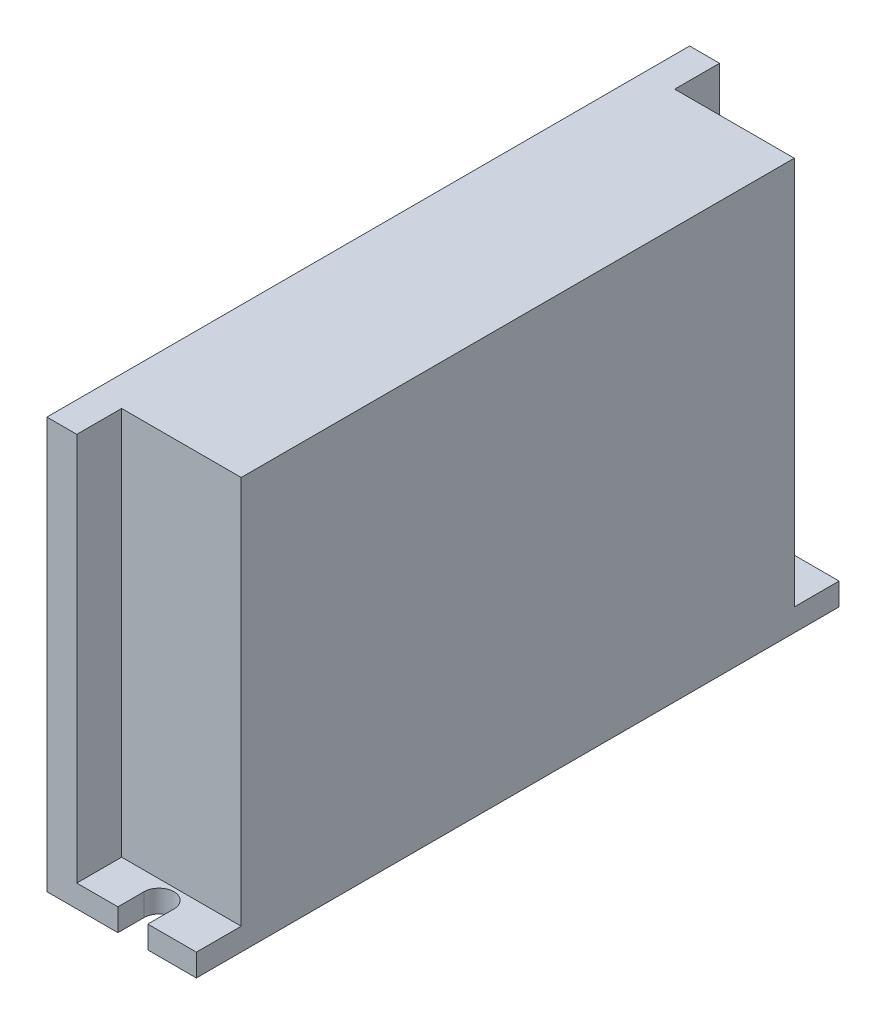
ISO-10303-21;
HEADER;
FILE_DESCRIPTION(('STEP AP214'),'2;1');
FILE_NAME('part.step','',(''),(''),'','','');
FILE_SCHEMA(('AUTOMOTIVE_DESIGN { 1 0 10303 214 1 1 1 1 }'));
ENDSEC;
DATA;
#1=APPLICATION_CONTEXT('core data for automotive mechanical design processes');
#2=APPLICATION_PROTOCOL_DEFINITION('international standard','automotive_design',2000,#1);
#3=PRODUCT_CONTEXT('',#1,'mechanical');
#4=PRODUCT('Part','Part','',(#3));
#5=PRODUCT_RELATED_PRODUCT_CATEGORY('part','',(#4));
#6=PRODUCT_DEFINITION_FORMATION('','',#4);
#7=PRODUCT_DEFINITION_CONTEXT('part definition',#1,'design');
#8=PRODUCT_DEFINITION('design','',#6,#7);
#9=PRODUCT_DEFINITION_SHAPE('','',#8);
#10=(LENGTH_UNIT() NAMED_UNIT(*) SI_UNIT(.MILLI.,.METRE.));
#11=(NAMED_UNIT(*) PLANE_ANGLE_UNIT() SI_UNIT($,.RADIAN.));
#12=(NAMED_UNIT(*) SI_UNIT($,.STERADIAN.) SOLID_ANGLE_UNIT());
#13=UNCERTAINTY_MEASURE_WITH_UNIT(LENGTH_MEASURE(1.E-05),#10,'distance_accuracy_value','');
#14=(GEOMETRIC_REPRESENTATION_CONTEXT(3) GLOBAL_UNCERTAINTY_ASSIGNED_CONTEXT((#13)) GLOBAL_UNIT_ASSIGNED_CONTEXT((#10,
#11,#12)) REPRESENTATION_CONTEXT('',''));
#15=CARTESIAN_POINT('',(0.,0.,0.));
#16=DIRECTION('',(0.,0.,1.));
#17=DIRECTION('',(1.,0.,0.));
#18=AXIS2_PLACEMENT_3D('',#15,#16,#17);
#19=CARTESIAN_POINT('',(0.,3.,0.));
#20=DIRECTION('',(0.,-1.,0.));
#21=DIRECTION('',(0.,0.,-1.));
#22=AXIS2_PLACEMENT_3D('',#19,#20,#21);
#23=PLANE('',#22);
#24=DIRECTION('',(-1.,0.,0.));
#25=VECTOR('',#24,1.);
#26=CARTESIAN_POINT('',(10.,3.,-37.));
#27=LINE('',#26,#25);
#28=CARTESIAN_POINT('',(10.,3.,-37.));
#29=VERTEX_POINT('',#28);
#30=CARTESIAN_POINT('',(-5.99999999999999,3.,-37.));
#31=VERTEX_POINT('',#30);
#32=EDGE_CURVE('E333',#29,#31,#27,.T.);
#33=ORIENTED_EDGE('',*,*,#32,.F.);
#34=DIRECTION('',(0.,0.,-1.));
#35=VECTOR('',#34,1.);
#36=CARTESIAN_POINT('',(10.,3.,43.));
#37=LINE('',#36,#35);
#38=CARTESIAN_POINT('',(10.,3.,-43.));
#39=VERTEX_POINT('',#38);
#40=EDGE_CURVE('E189',#29,#39,#37,.T.);
#41=ORIENTED_EDGE('',*,*,#40,.T.);
#42=DIRECTION('',(-1.,0.,0.));
#43=VECTOR('',#42,1.);
#44=CARTESIAN_POINT('',(-10.,3.,-43.));
#45=LINE('',#44,#43);
#46=CARTESIAN_POINT('',(3.49999999999999,3.,-43.));
#47=VERTEX_POINT('',#46);
#48=EDGE_CURVE('E271',#39,#47,#45,.T.);
#49=ORIENTED_EDGE('',*,*,#48,.T.);
#50=DIRECTION('',(0.,0.,-1.));
#51=VECTOR('',#50,1.);
#52=CARTESIAN_POINT('',(3.49999999999999,3.,-39.5));
#53=LINE('',#52,#51);
#54=CARTESIAN_POINT('',(3.49999999999999,3.,-39.5));
#55=VERTEX_POINT('',#54);
#56=EDGE_CURVE('E255',#55,#47,#53,.T.);
#57=ORIENTED_EDGE('',*,*,#56,.F.);
#58=CARTESIAN_POINT('',(1.49999999999999,3.,-39.5));
#59=DIRECTION('',(0.,1.,0.));
#60=DIRECTION('',(0.,0.,1.));
#61=AXIS2_PLACEMENT_3D('',#58,#59,#60);
#62=CIRCLE('',#61,2.);
#63=CARTESIAN_POINT('',(-0.50000000000001,3.,-39.5));
#64=VERTEX_POINT('',#63);
#65=EDGE_CURVE('E229',#64,#55,#62,.T.);
#66=ORIENTED_EDGE('',*,*,#65,.F.);
#67=DIRECTION('',(0.,0.,1.));
#68=VECTOR('',#67,1.);
#69=CARTESIAN_POINT('',(-0.50000000000001,3.,-39.5));
#70=LINE('',#69,#68);
#71=CARTESIAN_POINT('',(-0.500000000000021,3.,-43.));
#72=VERTEX_POINT('',#71);
#73=EDGE_CURVE('E252',#72,#64,#70,.T.);
#74=ORIENTED_EDGE('',*,*,#73,.F.);
#75=CARTESIAN_POINT('',(-6.,3.,-43.));
#76=VERTEX_POINT('',#75);
#77=EDGE_CURVE('E270',#72,#76,#45,.T.);
#78=ORIENTED_EDGE('',*,*,#77,.T.);
#79=DIRECTION('',(0.,0.,-1.));
#80=VECTOR('',#79,1.);
#81=CARTESIAN_POINT('',(-6.,3.,-43.));
#82=LINE('',#81,#80);
#83=EDGE_CURVE('E190',#31,#76,#82,.T.);
#84=ORIENTED_EDGE('',*,*,#83,.F.);
#85=EDGE_LOOP('',(#33,#41,#49,#57,#66,#74,#78,#84));
#86=FACE_BOUND('',#85,.T.);
#87=ADVANCED_FACE('F43',(#86),#23,.F.);
#88=DIRECTION('',(1.,0.,0.));
#89=VECTOR('',#88,1.);
#90=CARTESIAN_POINT('',(10.,3.,37.));
#91=LINE('',#90,#89);
#92=CARTESIAN_POINT('',(-5.99999999999999,3.,37.));
#93=VERTEX_POINT('',#92);
#94=CARTESIAN_POINT('',(10.,3.,37.));
#95=VERTEX_POINT('',#94);
#96=EDGE_CURVE('E184',#93,#95,#91,.T.);
#97=ORIENTED_EDGE('',*,*,#96,.F.);
#98=CARTESIAN_POINT('',(-5.99999999999999,3.,43.));
#99=VERTEX_POINT('',#98);
#100=EDGE_CURVE('E66',#99,#93,#82,.T.);
#101=ORIENTED_EDGE('',*,*,#100,.F.);
#102=DIRECTION('',(1.,0.,0.));
#103=VECTOR('',#102,1.);
#104=CARTESIAN_POINT('',(-10.,3.,43.));
#105=LINE('',#104,#103);
#106=CARTESIAN_POINT('',(-0.500000000000011,3.,43.));
#107=VERTEX_POINT('',#106);
#108=EDGE_CURVE('E275',#99,#107,#105,.T.);
#109=ORIENTED_EDGE('',*,*,#108,.T.);
#110=DIRECTION('',(0.,0.,1.));
#111=VECTOR('',#110,1.);
#112=CARTESIAN_POINT('',(-0.5,3.,39.5));
#113=LINE('',#112,#111);
#114=CARTESIAN_POINT('',(-0.5,3.,39.5));
#115=VERTEX_POINT('',#114);
#116=EDGE_CURVE('E228',#115,#107,#113,.T.);
#117=ORIENTED_EDGE('',*,*,#116,.F.);
#118=CARTESIAN_POINT('',(1.5,3.,39.5));
#119=DIRECTION('',(0.,1.,0.));
#120=DIRECTION('',(0.,0.,1.));
#121=AXIS2_PLACEMENT_3D('',#118,#119,#120);
#122=CIRCLE('',#121,2.);
#123=CARTESIAN_POINT('',(3.5,3.,39.5));
#124=VERTEX_POINT('',#123);
#125=EDGE_CURVE('E225',#124,#115,#122,.T.);
#126=ORIENTED_EDGE('',*,*,#125,.F.);
#127=DIRECTION('',(0.,0.,-1.));
#128=VECTOR('',#127,1.);
#129=CARTESIAN_POINT('',(3.5,3.,39.5));
#130=LINE('',#129,#128);
#131=CARTESIAN_POINT('',(3.5,3.,43.));
#132=VERTEX_POINT('',#131);
#133=EDGE_CURVE('E218',#132,#124,#130,.T.);
#134=ORIENTED_EDGE('',*,*,#133,.F.);
#135=CARTESIAN_POINT('',(10.,3.,43.));
#136=VERTEX_POINT('',#135);
#137=EDGE_CURVE('E274',#132,#136,#105,.T.);
#138=ORIENTED_EDGE('',*,*,#137,.T.);
#139=EDGE_CURVE('E267',#136,#95,#37,.T.);
#140=ORIENTED_EDGE('',*,*,#139,.T.);
#141=EDGE_LOOP('',(#97,#101,#109,#117,#126,#134,#138,#140));
#142=FACE_BOUND('',#141,.T.);
#143=ADVANCED_FACE('F343',(#142),#23,.F.);
#144=CARTESIAN_POINT('',(-6.,55.,-43.));
#145=DIRECTION('',(-1.,0.,0.));
#146=DIRECTION('',(0.,0.,1.));
#147=AXIS2_PLACEMENT_3D('',#144,#145,#146);
#148=PLANE('',#147);
#149=DIRECTION('',(0.,-1.,0.));
#150=VECTOR('',#149,1.);
#151=CARTESIAN_POINT('',(-5.99999999999999,55.,-37.));
#152=LINE('',#151,#150);
#153=CARTESIAN_POINT('',(-6.,55.,-37.));
#154=VERTEX_POINT('',#153);
#155=EDGE_CURVE('E58',#154,#31,#152,.T.);
#156=ORIENTED_EDGE('',*,*,#155,.T.);
#157=ORIENTED_EDGE('',*,*,#83,.T.);
#158=DIRECTION('',(0.,-1.,0.));
#159=VECTOR('',#158,1.);
#160=CARTESIAN_POINT('',(-6.,55.,-43.));
#161=LINE('',#160,#159);
#162=CARTESIAN_POINT('',(-6.,55.,-43.));
#163=VERTEX_POINT('',#162);
#164=EDGE_CURVE('E206',#163,#76,#161,.T.);
#165=ORIENTED_EDGE('',*,*,#164,.F.);
#166=DIRECTION('',(0.,0.,-1.));
#167=VECTOR('',#166,1.);
#168=CARTESIAN_POINT('',(-6.,55.,-43.));
#169=LINE('',#168,#167);
#170=EDGE_CURVE('E201',#154,#163,#169,.T.);
#171=ORIENTED_EDGE('',*,*,#170,.F.);
#172=EDGE_LOOP('',(#156,#157,#165,#171));
#173=FACE_BOUND('',#172,.T.);
#174=ADVANCED_FACE('F316',(#173),#148,.F.);
#175=DIRECTION('',(0.,-1.,0.));
#176=VECTOR('',#175,1.);
#177=CARTESIAN_POINT('',(-5.99999999999999,55.,37.));
#178=LINE('',#177,#176);
#179=CARTESIAN_POINT('',(-5.99999999999999,55.,37.));
#180=VERTEX_POINT('',#179);
#181=EDGE_CURVE('E193',#180,#93,#178,.T.);
#182=ORIENTED_EDGE('',*,*,#181,.F.);
#183=CARTESIAN_POINT('',(-5.99999999999999,55.,43.));
#184=VERTEX_POINT('',#183);
#185=EDGE_CURVE('E202',#184,#180,#169,.T.);
#186=ORIENTED_EDGE('',*,*,#185,.F.);
#187=DIRECTION('',(0.,-1.,0.));
#188=VECTOR('',#187,1.);
#189=CARTESIAN_POINT('',(-5.99999999999999,55.,43.));
#190=LINE('',#189,#188);
#191=EDGE_CURVE('E210',#184,#99,#190,.T.);
#192=ORIENTED_EDGE('',*,*,#191,.T.);
#193=ORIENTED_EDGE('',*,*,#100,.T.);
#194=EDGE_LOOP('',(#182,#186,#192,#193));
#195=FACE_BOUND('',#194,.T.);
#196=ADVANCED_FACE('F345',(#195),#148,.F.);
#197=CARTESIAN_POINT('',(-10.,3.,-43.));
#198=DIRECTION('',(0.,0.,1.));
#199=DIRECTION('',(1.,0.,0.));
#200=AXIS2_PLACEMENT_3D('',#197,#198,#199);
#201=PLANE('',#200);
#202=ORIENTED_EDGE('',*,*,#77,.F.);
#203=DIRECTION('',(0.,1.,0.));
#204=VECTOR('',#203,1.);
#205=CARTESIAN_POINT('',(-0.500000000000021,0.,-43.));
#206=LINE('',#205,#204);
#207=CARTESIAN_POINT('',(-0.500000000000021,0.,-43.));
#208=VERTEX_POINT('',#207);
#209=EDGE_CURVE('E249',#208,#72,#206,.T.);
#210=ORIENTED_EDGE('',*,*,#209,.F.);
#211=DIRECTION('',(-1.,0.,0.));
#212=VECTOR('',#211,1.);
#213=CARTESIAN_POINT('',(-10.,0.,-43.));
#214=LINE('',#213,#212);
#215=CARTESIAN_POINT('',(-10.,0.,-43.));
#216=VERTEX_POINT('',#215);
#217=EDGE_CURVE('E279',#208,#216,#214,.T.);
#218=ORIENTED_EDGE('',*,*,#217,.T.);
#219=DIRECTION('',(0.,-1.,0.));
#220=VECTOR('',#219,1.);
#221=CARTESIAN_POINT('',(-10.,3.,-43.));
#222=LINE('',#221,#220);
#223=CARTESIAN_POINT('',(-10.,55.,-43.));
#224=VERTEX_POINT('',#223);
#225=EDGE_CURVE('E51',#224,#216,#222,.T.);
#226=ORIENTED_EDGE('',*,*,#225,.F.);
#227=DIRECTION('',(-1.,0.,0.));
#228=VECTOR('',#227,1.);
#229=CARTESIAN_POINT('',(-10.,55.,-43.));
#230=LINE('',#229,#228);
#231=EDGE_CURVE('E204',#163,#224,#230,.T.);
#232=ORIENTED_EDGE('',*,*,#231,.F.);
#233=ORIENTED_EDGE('',*,*,#164,.T.);
#234=EDGE_LOOP('',(#202,#210,#218,#226,#232,#233));
#235=FACE_BOUND('',#234,.T.);
#236=ADVANCED_FACE('F312',(#235),#201,.F.);
#237=CARTESIAN_POINT('',(-10.,3.,43.));
#238=DIRECTION('',(0.,0.,-1.));
#239=DIRECTION('',(-1.,0.,0.));
#240=AXIS2_PLACEMENT_3D('',#237,#238,#239);
#241=PLANE('',#240);
#242=ORIENTED_EDGE('',*,*,#137,.F.);
#243=DIRECTION('',(0.,1.,0.));
#244=VECTOR('',#243,1.);
#245=CARTESIAN_POINT('',(3.5,0.,43.));
#246=LINE('',#245,#244);
#247=CARTESIAN_POINT('',(3.5,0.,43.));
#248=VERTEX_POINT('',#247);
#249=EDGE_CURVE('E237',#248,#132,#246,.T.);
#250=ORIENTED_EDGE('',*,*,#249,.F.);
#251=DIRECTION('',(1.,0.,0.));
#252=VECTOR('',#251,1.);
#253=CARTESIAN_POINT('',(-10.,0.,43.));
#254=LINE('',#253,#252);
#255=CARTESIAN_POINT('',(10.,0.,43.));
#256=VERTEX_POINT('',#255);
#257=EDGE_CURVE('E285',#248,#256,#254,.T.);
#258=ORIENTED_EDGE('',*,*,#257,.T.);
#259=DIRECTION('',(0.,-1.,0.));
#260=VECTOR('',#259,1.);
#261=CARTESIAN_POINT('',(10.,3.,43.));
#262=LINE('',#261,#260);
#263=EDGE_CURVE('E277',#136,#256,#262,.T.);
#264=ORIENTED_EDGE('',*,*,#263,.F.);
#265=EDGE_LOOP('',(#242,#250,#258,#264));
#266=FACE_BOUND('',#265,.T.);
#267=ADVANCED_FACE('F353',(#266),#241,.F.);
#268=CARTESIAN_POINT('',(10.,3.,43.));
#269=DIRECTION('',(-1.,0.,0.));
#270=DIRECTION('',(0.,0.,1.));
#271=AXIS2_PLACEMENT_3D('',#268,#269,#270);
#272=PLANE('',#271);
#273=DIRECTION('',(0.,0.,-1.));
#274=VECTOR('',#273,1.);
#275=CARTESIAN_POINT('',(10.,0.,43.));
#276=LINE('',#275,#274);
#277=CARTESIAN_POINT('',(10.,0.,-43.));
#278=VERTEX_POINT('',#277);
#279=EDGE_CURVE('E236',#256,#278,#276,.T.);
#280=ORIENTED_EDGE('',*,*,#279,.T.);
#281=DIRECTION('',(0.,-1.,0.));
#282=VECTOR('',#281,1.);
#283=CARTESIAN_POINT('',(10.,3.,-43.));
#284=LINE('',#283,#282);
#285=EDGE_CURVE('E11',#39,#278,#284,.T.);
#286=ORIENTED_EDGE('',*,*,#285,.F.);
#287=ORIENTED_EDGE('',*,*,#40,.F.);
#288=DIRECTION('',(0.,-1.,0.));
#289=VECTOR('',#288,1.);
#290=CARTESIAN_POINT('',(10.,55.,-37.));
#291=LINE('',#290,#289);
#292=CARTESIAN_POINT('',(10.,55.,-37.));
#293=VERTEX_POINT('',#292);
#294=EDGE_CURVE('E170',#293,#29,#291,.T.);
#295=ORIENTED_EDGE('',*,*,#294,.F.);
#296=DIRECTION('',(0.,0.,-1.));
#297=VECTOR('',#296,1.);
#298=CARTESIAN_POINT('',(10.,55.,-37.));
#299=LINE('',#298,#297);
#300=CARTESIAN_POINT('',(10.,55.,37.));
#301=VERTEX_POINT('',#300);
#302=EDGE_CURVE('E175',#301,#293,#299,.T.);
#303=ORIENTED_EDGE('',*,*,#302,.F.);
#304=DIRECTION('',(0.,-1.,0.));
#305=VECTOR('',#304,1.);
#306=CARTESIAN_POINT('',(10.,55.,37.));
#307=LINE('',#306,#305);
#308=EDGE_CURVE('E338',#301,#95,#307,.T.);
#309=ORIENTED_EDGE('',*,*,#308,.T.);
#310=ORIENTED_EDGE('',*,*,#139,.F.);
#311=ORIENTED_EDGE('',*,*,#263,.T.);
#312=EDGE_LOOP('',(#280,#286,#287,#295,#303,#309,#310,#311));
#313=FACE_BOUND('',#312,.T.);
#314=ADVANCED_FACE('F45',(#313),#272,.F.);
#315=CARTESIAN_POINT('',(3.49999999999999,0.,-43.));
#316=VERTEX_POINT('',#315);
#317=EDGE_CURVE('E280',#278,#316,#214,.T.);
#318=ORIENTED_EDGE('',*,*,#317,.T.);
#319=DIRECTION('',(0.,1.,0.));
#320=VECTOR('',#319,1.);
#321=CARTESIAN_POINT('',(3.49999999999999,0.,-43.));
#322=LINE('',#321,#320);
#323=EDGE_CURVE('E246',#316,#47,#322,.T.);
#324=ORIENTED_EDGE('',*,*,#323,.T.);
#325=ORIENTED_EDGE('',*,*,#48,.F.);
#326=ORIENTED_EDGE('',*,*,#285,.T.);
#327=EDGE_LOOP('',(#318,#324,#325,#326));
#328=FACE_BOUND('',#327,.T.);
#329=ADVANCED_FACE('F332',(#328),#201,.F.);
#330=CARTESIAN_POINT('',(-10.,3.,43.));
#331=DIRECTION('',(1.,0.,0.));
#332=DIRECTION('',(0.,0.,-1.));
#333=AXIS2_PLACEMENT_3D('',#330,#331,#332);
#334=PLANE('',#333);
#335=DIRECTION('',(0.,0.,1.));
#336=VECTOR('',#335,1.);
#337=CARTESIAN_POINT('',(-10.,0.,43.));
#338=LINE('',#337,#336);
#339=CARTESIAN_POINT('',(-10.,0.,43.));
#340=VERTEX_POINT('',#339);
#341=EDGE_CURVE('E283',#216,#340,#338,.T.);
#342=ORIENTED_EDGE('',*,*,#341,.T.);
#343=DIRECTION('',(0.,-1.,0.));
#344=VECTOR('',#343,1.);
#345=CARTESIAN_POINT('',(-10.,3.,43.));
#346=LINE('',#345,#344);
#347=CARTESIAN_POINT('',(-10.,55.,43.));
#348=VERTEX_POINT('',#347);
#349=EDGE_CURVE('E291',#348,#340,#346,.T.);
#350=ORIENTED_EDGE('',*,*,#349,.F.);
#351=DIRECTION('',(0.,0.,1.));
#352=VECTOR('',#351,1.);
#353=CARTESIAN_POINT('',(-10.,55.,-43.));
#354=LINE('',#353,#352);
#355=EDGE_CURVE('E197',#224,#348,#354,.T.);
#356=ORIENTED_EDGE('',*,*,#355,.F.);
#357=ORIENTED_EDGE('',*,*,#225,.T.);
#358=EDGE_LOOP('',(#342,#350,#356,#357));
#359=FACE_BOUND('',#358,.T.);
#360=ADVANCED_FACE('F297',(#359),#334,.F.);
#361=CARTESIAN_POINT('',(-0.500000000000006,0.,43.));
#362=VERTEX_POINT('',#361);
#363=EDGE_CURVE('E286',#340,#362,#254,.T.);
#364=ORIENTED_EDGE('',*,*,#363,.T.);
#365=DIRECTION('',(0.,1.,0.));
#366=VECTOR('',#365,1.);
#367=CARTESIAN_POINT('',(-0.500000000000011,0.,43.));
#368=LINE('',#367,#366);
#369=EDGE_CURVE('E239',#362,#107,#368,.T.);
#370=ORIENTED_EDGE('',*,*,#369,.T.);
#371=ORIENTED_EDGE('',*,*,#108,.F.);
#372=ORIENTED_EDGE('',*,*,#191,.F.);
#373=DIRECTION('',(1.,0.,0.));
#374=VECTOR('',#373,1.);
#375=CARTESIAN_POINT('',(-10.,55.,43.));
#376=LINE('',#375,#374);
#377=EDGE_CURVE('E199',#348,#184,#376,.T.);
#378=ORIENTED_EDGE('',*,*,#377,.F.);
#379=ORIENTED_EDGE('',*,*,#349,.T.);
#380=EDGE_LOOP('',(#364,#370,#371,#372,#378,#379));
#381=FACE_BOUND('',#380,.T.);
#382=ADVANCED_FACE('F306',(#381),#241,.F.);
#383=CARTESIAN_POINT('',(0.,0.,0.));
#384=DIRECTION('',(0.,-1.,0.));
#385=DIRECTION('',(0.,0.,-1.));
#386=AXIS2_PLACEMENT_3D('',#383,#384,#385);
#387=PLANE('',#386);
#388=DIRECTION('',(0.,0.,-1.));
#389=VECTOR('',#388,1.);
#390=CARTESIAN_POINT('',(3.5,0.,39.5));
#391=LINE('',#390,#389);
#392=CARTESIAN_POINT('',(3.5,0.,39.5));
#393=VERTEX_POINT('',#392);
#394=EDGE_CURVE('E221',#248,#393,#391,.T.);
#395=ORIENTED_EDGE('',*,*,#394,.T.);
#396=CARTESIAN_POINT('',(1.5,0.,39.5));
#397=DIRECTION('',(0.,1.,0.));
#398=DIRECTION('',(0.,0.,1.));
#399=AXIS2_PLACEMENT_3D('',#396,#397,#398);
#400=CIRCLE('',#399,2.);
#401=CARTESIAN_POINT('',(-0.5,0.,39.5));
#402=VERTEX_POINT('',#401);
#403=EDGE_CURVE('E214',#393,#402,#400,.T.);
#404=ORIENTED_EDGE('',*,*,#403,.T.);
#405=DIRECTION('',(0.,0.,1.));
#406=VECTOR('',#405,1.);
#407=CARTESIAN_POINT('',(-0.5,0.,39.5));
#408=LINE('',#407,#406);
#409=EDGE_CURVE('E217',#402,#362,#408,.T.);
#410=ORIENTED_EDGE('',*,*,#409,.T.);
#411=ORIENTED_EDGE('',*,*,#363,.F.);
#412=ORIENTED_EDGE('',*,*,#341,.F.);
#413=ORIENTED_EDGE('',*,*,#217,.F.);
#414=DIRECTION('',(0.,0.,1.));
#415=VECTOR('',#414,1.);
#416=CARTESIAN_POINT('',(-0.50000000000001,0.,-39.5));
#417=LINE('',#416,#415);
#418=CARTESIAN_POINT('',(-0.50000000000001,0.,-39.5));
#419=VERTEX_POINT('',#418);
#420=EDGE_CURVE('E245',#208,#419,#417,.T.);
#421=ORIENTED_EDGE('',*,*,#420,.T.);
#422=CARTESIAN_POINT('',(1.49999999999999,0.,-39.5));
#423=DIRECTION('',(0.,1.,0.));
#424=DIRECTION('',(0.,0.,1.));
#425=AXIS2_PLACEMENT_3D('',#422,#423,#424);
#426=CIRCLE('',#425,2.);
#427=CARTESIAN_POINT('',(3.49999999999999,0.,-39.5));
#428=VERTEX_POINT('',#427);
#429=EDGE_CURVE('E256',#419,#428,#426,.T.);
#430=ORIENTED_EDGE('',*,*,#429,.T.);
#431=DIRECTION('',(0.,0.,-1.));
#432=VECTOR('',#431,1.);
#433=CARTESIAN_POINT('',(3.49999999999999,0.,-39.5));
#434=LINE('',#433,#432);
#435=EDGE_CURVE('E262',#428,#316,#434,.T.);
#436=ORIENTED_EDGE('',*,*,#435,.T.);
#437=ORIENTED_EDGE('',*,*,#317,.F.);
#438=ORIENTED_EDGE('',*,*,#279,.F.);
#439=ORIENTED_EDGE('',*,*,#257,.F.);
#440=EDGE_LOOP('',(#395,#404,#410,#411,#412,#413,#421,#430,#436,#437,#438,#439));
#441=FACE_BOUND('',#440,.T.);
#442=ADVANCED_FACE('F303',(#441),#387,.T.);
#443=CARTESIAN_POINT('',(1.49999999999999,0.,-39.5));
#444=DIRECTION('',(0.,1.,0.));
#445=DIRECTION('',(0.,0.,1.));
#446=AXIS2_PLACEMENT_3D('',#443,#444,#445);
#447=CYLINDRICAL_SURFACE('',#446,2.);
#448=ORIENTED_EDGE('',*,*,#65,.T.);
#449=DIRECTION('',(0.,1.,0.));
#450=VECTOR('',#449,1.);
#451=CARTESIAN_POINT('',(3.49999999999999,0.,-39.5));
#452=LINE('',#451,#450);
#453=EDGE_CURVE('E243',#428,#55,#452,.T.);
#454=ORIENTED_EDGE('',*,*,#453,.F.);
#455=ORIENTED_EDGE('',*,*,#429,.F.);
#456=DIRECTION('',(0.,1.,0.));
#457=VECTOR('',#456,1.);
#458=CARTESIAN_POINT('',(-0.50000000000001,0.,-39.5));
#459=LINE('',#458,#457);
#460=EDGE_CURVE('E213',#419,#64,#459,.T.);
#461=ORIENTED_EDGE('',*,*,#460,.T.);
#462=EDGE_LOOP('',(#448,#454,#455,#461));
#463=FACE_BOUND('',#462,.T.);
#464=ADVANCED_FACE('F327',(#463),#447,.F.);
#465=CARTESIAN_POINT('',(-0.50000000000001,0.,-39.5));
#466=DIRECTION('',(-1.,0.,0.));
#467=DIRECTION('',(0.,0.,1.));
#468=AXIS2_PLACEMENT_3D('',#465,#466,#467);
#469=PLANE('',#468);
#470=ORIENTED_EDGE('',*,*,#73,.T.);
#471=ORIENTED_EDGE('',*,*,#460,.F.);
#472=ORIENTED_EDGE('',*,*,#420,.F.);
#473=ORIENTED_EDGE('',*,*,#209,.T.);
#474=EDGE_LOOP('',(#470,#471,#472,#473));
#475=FACE_BOUND('',#474,.T.);
#476=ADVANCED_FACE('F323',(#475),#469,.F.);
#477=CARTESIAN_POINT('',(3.49999999999999,0.,-39.5));
#478=DIRECTION('',(1.,0.,0.));
#479=DIRECTION('',(0.,0.,-1.));
#480=AXIS2_PLACEMENT_3D('',#477,#478,#479);
#481=PLANE('',#480);
#482=ORIENTED_EDGE('',*,*,#56,.T.);
#483=ORIENTED_EDGE('',*,*,#323,.F.);
#484=ORIENTED_EDGE('',*,*,#435,.F.);
#485=ORIENTED_EDGE('',*,*,#453,.T.);
#486=EDGE_LOOP('',(#482,#483,#484,#485));
#487=FACE_BOUND('',#486,.T.);
#488=ADVANCED_FACE('F329',(#487),#481,.F.);
#489=CARTESIAN_POINT('',(1.5,0.,39.5));
#490=DIRECTION('',(0.,1.,0.));
#491=DIRECTION('',(0.,0.,1.));
#492=AXIS2_PLACEMENT_3D('',#489,#490,#491);
#493=CYLINDRICAL_SURFACE('',#492,2.);
#494=ORIENTED_EDGE('',*,*,#125,.T.);
#495=DIRECTION('',(0.,1.,0.));
#496=VECTOR('',#495,1.);
#497=CARTESIAN_POINT('',(-0.5,0.,39.5));
#498=LINE('',#497,#496);
#499=EDGE_CURVE('E224',#402,#115,#498,.T.);
#500=ORIENTED_EDGE('',*,*,#499,.F.);
#501=ORIENTED_EDGE('',*,*,#403,.F.);
#502=DIRECTION('',(0.,1.,0.));
#503=VECTOR('',#502,1.);
#504=CARTESIAN_POINT('',(3.5,0.,39.5));
#505=LINE('',#504,#503);
#506=EDGE_CURVE('E234',#393,#124,#505,.T.);
#507=ORIENTED_EDGE('',*,*,#506,.T.);
#508=EDGE_LOOP('',(#494,#500,#501,#507));
#509=FACE_BOUND('',#508,.T.);
#510=ADVANCED_FACE('F391',(#509),#493,.F.);
#511=CARTESIAN_POINT('',(3.5,0.,39.5));
#512=DIRECTION('',(1.,0.,0.));
#513=DIRECTION('',(0.,0.,-1.));
#514=AXIS2_PLACEMENT_3D('',#511,#512,#513);
#515=PLANE('',#514);
#516=ORIENTED_EDGE('',*,*,#133,.T.);
#517=ORIENTED_EDGE('',*,*,#506,.F.);
#518=ORIENTED_EDGE('',*,*,#394,.F.);
#519=ORIENTED_EDGE('',*,*,#249,.T.);
#520=EDGE_LOOP('',(#516,#517,#518,#519));
#521=FACE_BOUND('',#520,.T.);
#522=ADVANCED_FACE('F387',(#521),#515,.F.);
#523=CARTESIAN_POINT('',(-0.5,0.,39.5));
#524=DIRECTION('',(-1.,0.,0.));
#525=DIRECTION('',(0.,0.,1.));
#526=AXIS2_PLACEMENT_3D('',#523,#524,#525);
#527=PLANE('',#526);
#528=ORIENTED_EDGE('',*,*,#116,.T.);
#529=ORIENTED_EDGE('',*,*,#369,.F.);
#530=ORIENTED_EDGE('',*,*,#409,.F.);
#531=ORIENTED_EDGE('',*,*,#499,.T.);
#532=EDGE_LOOP('',(#528,#529,#530,#531));
#533=FACE_BOUND('',#532,.T.);
#534=ADVANCED_FACE('F393',(#533),#527,.F.);
#535=CARTESIAN_POINT('',(0.,55.,0.));
#536=DIRECTION('',(0.,1.,0.));
#537=DIRECTION('',(0.,0.,1.));
#538=AXIS2_PLACEMENT_3D('',#535,#536,#537);
#539=PLANE('',#538);
#540=ORIENTED_EDGE('',*,*,#355,.T.);
#541=ORIENTED_EDGE('',*,*,#377,.T.);
#542=ORIENTED_EDGE('',*,*,#185,.T.);
#543=DIRECTION('',(1.,0.,0.));
#544=VECTOR('',#543,1.);
#545=CARTESIAN_POINT('',(10.,55.,37.));
#546=LINE('',#545,#544);
#547=EDGE_CURVE('E174',#180,#301,#546,.T.);
#548=ORIENTED_EDGE('',*,*,#547,.T.);
#549=ORIENTED_EDGE('',*,*,#302,.T.);
#550=DIRECTION('',(-1.,0.,0.));
#551=VECTOR('',#550,1.);
#552=CARTESIAN_POINT('',(10.,55.,-37.));
#553=LINE('',#552,#551);
#554=EDGE_CURVE('E166',#293,#154,#553,.T.);
#555=ORIENTED_EDGE('',*,*,#554,.T.);
#556=ORIENTED_EDGE('',*,*,#170,.T.);
#557=ORIENTED_EDGE('',*,*,#231,.T.);
#558=EDGE_LOOP('',(#540,#541,#542,#548,#549,#555,#556,#557));
#559=FACE_BOUND('',#558,.T.);
#560=ADVANCED_FACE('F179',(#559),#539,.T.);
#561=CARTESIAN_POINT('',(10.,55.,-37.));
#562=DIRECTION('',(0.,0.,1.));
#563=DIRECTION('',(1.,0.,0.));
#564=AXIS2_PLACEMENT_3D('',#561,#562,#563);
#565=PLANE('',#564);
#566=ORIENTED_EDGE('',*,*,#32,.T.);
#567=ORIENTED_EDGE('',*,*,#155,.F.);
#568=ORIENTED_EDGE('',*,*,#554,.F.);
#569=ORIENTED_EDGE('',*,*,#294,.T.);
#570=EDGE_LOOP('',(#566,#567,#568,#569));
#571=FACE_BOUND('',#570,.T.);
#572=ADVANCED_FACE('F168',(#571),#565,.F.);
#573=CARTESIAN_POINT('',(10.,55.,37.));
#574=DIRECTION('',(0.,0.,-1.));
#575=DIRECTION('',(-1.,0.,0.));
#576=AXIS2_PLACEMENT_3D('',#573,#574,#575);
#577=PLANE('',#576);
#578=ORIENTED_EDGE('',*,*,#96,.T.);
#579=ORIENTED_EDGE('',*,*,#308,.F.);
#580=ORIENTED_EDGE('',*,*,#547,.F.);
#581=ORIENTED_EDGE('',*,*,#181,.T.);
#582=EDGE_LOOP('',(#578,#579,#580,#581));
#583=FACE_BOUND('',#582,.T.);
#584=ADVANCED_FACE('F341',(#583),#577,.F.);
#585=CLOSED_SHELL('',(#87,#143,#174,#196,#236,#267,#314,#329,#360,#382,#442,#464,#476,#488,#510,
#522,#534,#560,#572,#584));
#586=MANIFOLD_SOLID_BREP('B2',#585);
#587=ADVANCED_BREP_SHAPE_REPRESENTATION('',(#18,#586),#14);
#588=SHAPE_DEFINITION_REPRESENTATION(#9,#587);
ENDSEC;
END-ISO-10303-21;
